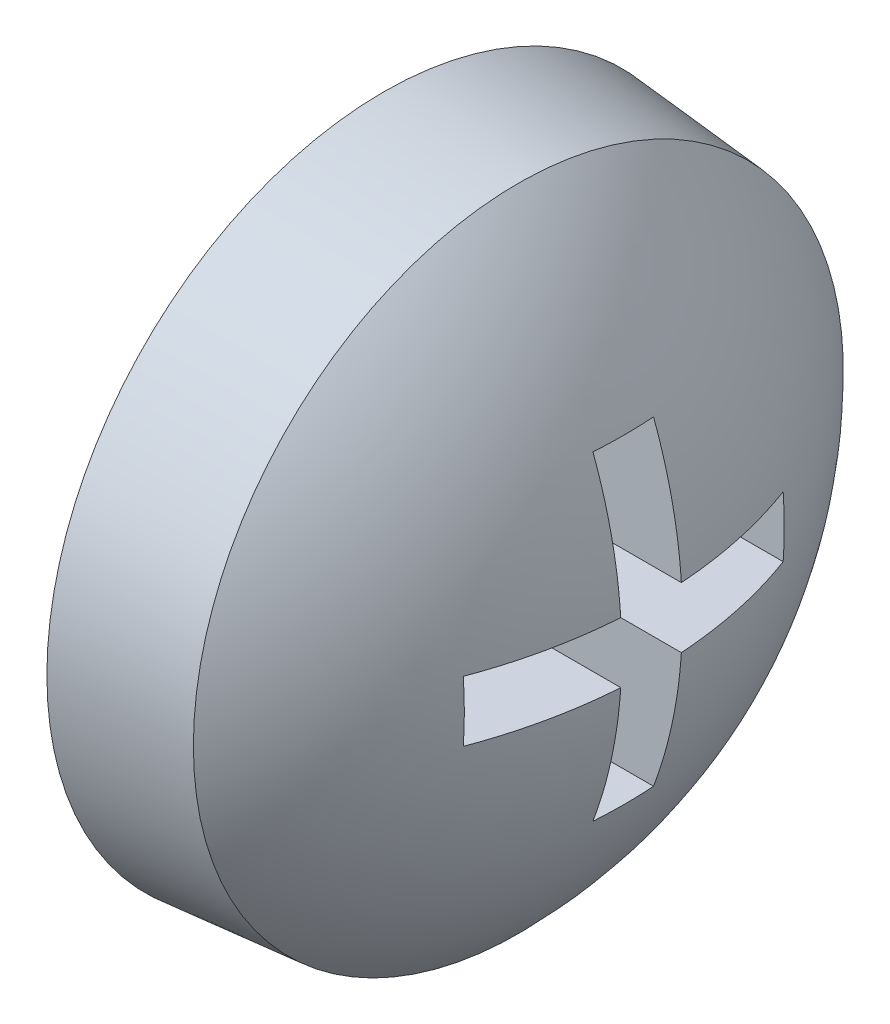
ISO-10303-21;
HEADER;
FILE_DESCRIPTION(('STEP AP214'),'2;1');
FILE_NAME('part.step','',(''),(''),'','','');
FILE_SCHEMA(('AUTOMOTIVE_DESIGN { 1 0 10303 214 1 1 1 1 }'));
ENDSEC;
DATA;
#1=APPLICATION_CONTEXT('core data for automotive mechanical design processes');
#2=APPLICATION_PROTOCOL_DEFINITION('international standard','automotive_design',2000,#1);
#3=PRODUCT_CONTEXT('',#1,'mechanical');
#4=PRODUCT('Part','Part','',(#3));
#5=PRODUCT_RELATED_PRODUCT_CATEGORY('part','',(#4));
#6=PRODUCT_DEFINITION_FORMATION('','',#4);
#7=PRODUCT_DEFINITION_CONTEXT('part definition',#1,'design');
#8=PRODUCT_DEFINITION('design','',#6,#7);
#9=PRODUCT_DEFINITION_SHAPE('','',#8);
#10=(LENGTH_UNIT() NAMED_UNIT(*) SI_UNIT(.MILLI.,.METRE.));
#11=(NAMED_UNIT(*) PLANE_ANGLE_UNIT() SI_UNIT($,.RADIAN.));
#12=(NAMED_UNIT(*) SI_UNIT($,.STERADIAN.) SOLID_ANGLE_UNIT());
#13=UNCERTAINTY_MEASURE_WITH_UNIT(LENGTH_MEASURE(1.E-05),#10,'distance_accuracy_value','');
#14=(GEOMETRIC_REPRESENTATION_CONTEXT(3) GLOBAL_UNCERTAINTY_ASSIGNED_CONTEXT((#13)) GLOBAL_UNIT_ASSIGNED_CONTEXT((#10,
#11,#12)) REPRESENTATION_CONTEXT('',''));
#15=CARTESIAN_POINT('',(0.,0.,0.));
#16=DIRECTION('',(0.,0.,1.));
#17=DIRECTION('',(1.,0.,0.));
#18=AXIS2_PLACEMENT_3D('',#15,#16,#17);
#19=CARTESIAN_POINT('',(219.066666666667,-6.9,10.));
#20=DIRECTION('',(1.,0.,0.));
#21=DIRECTION('',(0.,0.,-1.));
#22=AXIS2_PLACEMENT_3D('',#19,#20,#21);
#23=PLANE('',#22);
#24=DIRECTION('',(0.,0.,1.));
#25=VECTOR('',#24,1.);
#26=CARTESIAN_POINT('',(219.066666666667,-7.85,10.));
#27=LINE('',#26,#25);
#28=CARTESIAN_POINT('',(219.066666666667,-7.85,9.82));
#29=VERTEX_POINT('',#28);
#30=CARTESIAN_POINT('',(219.066666666667,-7.85,10.18));
#31=VERTEX_POINT('',#30);
#32=EDGE_CURVE('E293',#29,#31,#27,.T.);
#33=ORIENTED_EDGE('',*,*,#32,.F.);
#34=DIRECTION('',(0.,1.,0.));
#35=VECTOR('',#34,1.);
#36=CARTESIAN_POINT('',(219.066666666667,-6.9,9.82));
#37=LINE('',#36,#35);
#38=CARTESIAN_POINT('',(219.066666666667,-7.08,9.82));
#39=VERTEX_POINT('',#38);
#40=EDGE_CURVE('E298',#39,#29,#37,.F.);
#41=ORIENTED_EDGE('',*,*,#40,.F.);
#42=DIRECTION('',(0.,0.,1.));
#43=VECTOR('',#42,1.);
#44=CARTESIAN_POINT('',(219.066666666667,-7.08,10.));
#45=LINE('',#44,#43);
#46=CARTESIAN_POINT('',(219.066666666667,-7.08,9.05));
#47=VERTEX_POINT('',#46);
#48=EDGE_CURVE('E303',#47,#39,#45,.T.);
#49=ORIENTED_EDGE('',*,*,#48,.F.);
#50=DIRECTION('',(0.,1.,0.));
#51=VECTOR('',#50,1.);
#52=CARTESIAN_POINT('',(219.066666666667,-6.9,9.05));
#53=LINE('',#52,#51);
#54=CARTESIAN_POINT('',(219.066666666667,-6.72,9.05));
#55=VERTEX_POINT('',#54);
#56=EDGE_CURVE('E308',#55,#47,#53,.F.);
#57=ORIENTED_EDGE('',*,*,#56,.F.);
#58=DIRECTION('',(0.,0.,-1.));
#59=VECTOR('',#58,1.);
#60=CARTESIAN_POINT('',(219.066666666667,-6.72,10.));
#61=LINE('',#60,#59);
#62=CARTESIAN_POINT('',(219.066666666667,-6.72,9.82));
#63=VERTEX_POINT('',#62);
#64=EDGE_CURVE('E313',#63,#55,#61,.T.);
#65=ORIENTED_EDGE('',*,*,#64,.F.);
#66=DIRECTION('',(0.,1.,0.));
#67=VECTOR('',#66,1.);
#68=CARTESIAN_POINT('',(219.066666666667,-6.9,9.82));
#69=LINE('',#68,#67);
#70=CARTESIAN_POINT('',(219.066666666667,-5.95,9.82));
#71=VERTEX_POINT('',#70);
#72=EDGE_CURVE('E318',#71,#63,#69,.F.);
#73=ORIENTED_EDGE('',*,*,#72,.F.);
#74=DIRECTION('',(0.,0.,1.));
#75=VECTOR('',#74,1.);
#76=CARTESIAN_POINT('',(219.066666666667,-5.95,10.));
#77=LINE('',#76,#75);
#78=CARTESIAN_POINT('',(219.066666666667,-5.95,10.18));
#79=VERTEX_POINT('',#78);
#80=EDGE_CURVE('E267',#71,#79,#77,.T.);
#81=ORIENTED_EDGE('',*,*,#80,.T.);
#82=DIRECTION('',(0.,1.,0.));
#83=VECTOR('',#82,1.);
#84=CARTESIAN_POINT('',(219.066666666667,-6.9,10.18));
#85=LINE('',#84,#83);
#86=CARTESIAN_POINT('',(219.066666666667,-6.72,10.18));
#87=VERTEX_POINT('',#86);
#88=EDGE_CURVE('E264',#87,#79,#85,.T.);
#89=ORIENTED_EDGE('',*,*,#88,.F.);
#90=DIRECTION('',(0.,0.,-1.));
#91=VECTOR('',#90,1.);
#92=CARTESIAN_POINT('',(219.066666666667,-6.72,10.));
#93=LINE('',#92,#91);
#94=CARTESIAN_POINT('',(219.066666666667,-6.72,10.95));
#95=VERTEX_POINT('',#94);
#96=EDGE_CURVE('E260',#95,#87,#93,.T.);
#97=ORIENTED_EDGE('',*,*,#96,.F.);
#98=DIRECTION('',(0.,1.,0.));
#99=VECTOR('',#98,1.);
#100=CARTESIAN_POINT('',(219.066666666667,-6.9,10.95));
#101=LINE('',#100,#99);
#102=CARTESIAN_POINT('',(219.066666666667,-7.08,10.95));
#103=VERTEX_POINT('',#102);
#104=EDGE_CURVE('E231',#95,#103,#101,.F.);
#105=ORIENTED_EDGE('',*,*,#104,.T.);
#106=DIRECTION('',(0.,0.,1.));
#107=VECTOR('',#106,1.);
#108=CARTESIAN_POINT('',(219.066666666667,-7.08,10.));
#109=LINE('',#108,#107);
#110=CARTESIAN_POINT('',(219.066666666667,-7.08,10.18));
#111=VERTEX_POINT('',#110);
#112=EDGE_CURVE('E278',#111,#103,#109,.T.);
#113=ORIENTED_EDGE('',*,*,#112,.F.);
#114=DIRECTION('',(0.,1.,0.));
#115=VECTOR('',#114,1.);
#116=CARTESIAN_POINT('',(219.066666666667,-6.9,10.18));
#117=LINE('',#116,#115);
#118=EDGE_CURVE('E288',#31,#111,#117,.T.);
#119=ORIENTED_EDGE('',*,*,#118,.F.);
#120=EDGE_LOOP('',(#33,#41,#49,#57,#65,#73,#81,#89,#97,#105,#113,#119));
#121=FACE_BOUND('',#120,.T.);
#122=ADVANCED_FACE('F17',(#121),#23,.T.);
#123=CARTESIAN_POINT('',(219.666666666667,-6.72,10.));
#124=DIRECTION('',(0.,-1.,0.));
#125=DIRECTION('',(0.,0.,-1.));
#126=AXIS2_PLACEMENT_3D('',#123,#124,#125);
#127=PLANE('',#126);
#128=DIRECTION('',(1.,0.,0.));
#129=VECTOR('',#128,1.);
#130=CARTESIAN_POINT('',(219.666666666667,-6.72,10.95));
#131=LINE('',#130,#129);
#132=CARTESIAN_POINT('',(220.089571189858,-6.72,10.9499999999999));
#133=VERTEX_POINT('',#132);
#134=EDGE_CURVE('E89',#133,#95,#131,.F.);
#135=ORIENTED_EDGE('',*,*,#134,.T.);
#136=ORIENTED_EDGE('',*,*,#96,.T.);
#137=DIRECTION('',(-1.,0.,0.));
#138=VECTOR('',#137,1.);
#139=CARTESIAN_POINT('',(219.666666666667,-6.72,10.18));
#140=LINE('',#139,#138);
#141=CARTESIAN_POINT('',(220.254764236461,-6.72000000000002,10.18));
#142=VERTEX_POINT('',#141);
#143=EDGE_CURVE('E224',#142,#87,#140,.T.);
#144=ORIENTED_EDGE('',*,*,#143,.F.);
#145=CARTESIAN_POINT('',(220.089571189858,-6.72,10.9499999999998));
#146=CARTESIAN_POINT('',(220.101116204051,-6.72,10.9189995540504));
#147=CARTESIAN_POINT('',(220.112095586435,-6.72,10.8877884938065));
#148=CARTESIAN_POINT('',(220.132868784973,-6.72,10.8251104536467));
#149=CARTESIAN_POINT('',(220.142667091984,-6.72,10.7936449620739));
#150=CARTESIAN_POINT('',(220.161090632624,-6.72,10.7304618501354));
#151=CARTESIAN_POINT('',(220.169718872253,-6.72,10.6987451062671));
#152=CARTESIAN_POINT('',(220.18581062142,-6.72,10.6350619663154));
#153=CARTESIAN_POINT('',(220.193275650242,-6.72,10.6030959541241));
#154=CARTESIAN_POINT('',(220.207044828628,-6.72,10.5389148788567));
#155=CARTESIAN_POINT('',(220.213348978193,-6.72,10.5066998157807));
#156=CARTESIAN_POINT('',(220.224795725559,-6.72,10.4420201537523));
#157=CARTESIAN_POINT('',(220.229936780304,-6.72,10.4095552817085));
#158=CARTESIAN_POINT('',(220.239051828977,-6.72,10.3443751591892));
#159=CARTESIAN_POINT('',(220.243022721906,-6.72,10.3116594750372));
#160=CARTESIAN_POINT('',(220.249787708815,-6.72,10.2459761632456));
#161=CARTESIAN_POINT('',(220.252577096634,-6.72,10.2130080508537));
#162=CARTESIAN_POINT('',(220.25476423646,-6.72,10.18));
#163=B_SPLINE_CURVE_WITH_KNOTS('',3,(#145,#146,#147,#148,#149,#150,#151,#152,#153,#154,#155,
#156,#157,#158,#159,#160,#161,#162),.UNSPECIFIED.,.F.,.F.,(4,2,2,2,2,2,2,2,4),(0.,
0.0992357442434007,0.198081387639233,0.296668072480423,0.395124892694009,0.493581712907595,
0.592168397748798,0.691014041144628,0.790249785388024),.UNSPECIFIED.);
#164=EDGE_CURVE('E20',#133,#142,#163,.T.);
#165=ORIENTED_EDGE('',*,*,#164,.F.);
#166=EDGE_LOOP('',(#135,#136,#144,#165));
#167=FACE_BOUND('',#166,.T.);
#168=ADVANCED_FACE('F221',(#167),#127,.T.);
#169=CARTESIAN_POINT('',(219.666666666667,-6.9,10.18));
#170=DIRECTION('',(0.,0.,-1.));
#171=DIRECTION('',(-1.,0.,0.));
#172=AXIS2_PLACEMENT_3D('',#169,#170,#171);
#173=PLANE('',#172);
#174=ORIENTED_EDGE('',*,*,#88,.T.);
#175=DIRECTION('',(1.,0.,0.));
#176=VECTOR('',#175,1.);
#177=CARTESIAN_POINT('',(219.666666666667,-5.95,10.18));
#178=LINE('',#177,#176);
#179=CARTESIAN_POINT('',(220.089571189858,-5.95,10.18));
#180=VERTEX_POINT('',#179);
#181=EDGE_CURVE('E324',#79,#180,#178,.T.);
#182=ORIENTED_EDGE('',*,*,#181,.T.);
#183=CARTESIAN_POINT('',(220.25476423646,-6.72000000000004,10.18));
#184=CARTESIAN_POINT('',(220.249110057772,-6.63440991744423,10.18));
#185=CARTESIAN_POINT('',(220.239378570371,-6.54909652262237,10.18));
#186=CARTESIAN_POINT('',(220.212011452855,-6.38034093840239,10.18));
#187=CARTESIAN_POINT('',(220.194429898816,-6.29688998051813,10.18));
#188=CARTESIAN_POINT('',(220.149700769254,-6.12495750840967,10.18));
#189=CARTESIAN_POINT('',(220.121864706158,-6.03665468899671,10.18));
#190=CARTESIAN_POINT('',(220.089571189858,-5.9500000000002,10.18));
#191=B_SPLINE_CURVE_WITH_KNOTS('',3,(#183,#184,#185,#186,#187,#188,#189,#190),.UNSPECIFIED.,.F.,
.F.,(4,2,2,4),(0.,0.257221658829311,0.512698117737292,0.789983486231445),.UNSPECIFIED.);
#192=EDGE_CURVE('E213',#142,#180,#191,.T.);
#193=ORIENTED_EDGE('',*,*,#192,.F.);
#194=ORIENTED_EDGE('',*,*,#143,.T.);
#195=EDGE_LOOP('',(#174,#182,#193,#194));
#196=FACE_BOUND('',#195,.T.);
#197=ADVANCED_FACE('F204',(#196),#173,.T.);
#198=CARTESIAN_POINT('',(219.666666666667,-5.95,10.));
#199=DIRECTION('',(0.,1.,0.));
#200=DIRECTION('',(0.,0.,1.));
#201=AXIS2_PLACEMENT_3D('',#198,#199,#200);
#202=PLANE('',#201);
#203=ORIENTED_EDGE('',*,*,#181,.F.);
#204=ORIENTED_EDGE('',*,*,#80,.F.);
#205=DIRECTION('',(1.,0.,0.));
#206=VECTOR('',#205,1.);
#207=CARTESIAN_POINT('',(219.666666666667,-5.95,9.82));
#208=LINE('',#207,#206);
#209=CARTESIAN_POINT('',(220.089571189858,-5.9500000000001,9.82));
#210=VERTEX_POINT('',#209);
#211=EDGE_CURVE('E320',#210,#71,#208,.F.);
#212=ORIENTED_EDGE('',*,*,#211,.F.);
#213=CARTESIAN_POINT('',(220.089571189857,-5.95,10.18));
#214=CARTESIAN_POINT('',(220.093799585556,-5.94999999999998,10.12));
#215=CARTESIAN_POINT('',(220.095913783405,-5.94999999999998,10.06));
#216=CARTESIAN_POINT('',(220.095913783405,-5.95000000000002,9.93999999999997));
#217=CARTESIAN_POINT('',(220.093799585556,-5.95000000000006,9.87999999999998));
#218=CARTESIAN_POINT('',(220.089571189857,-5.95000000000011,9.81999999999998));
#219=B_SPLINE_CURVE_WITH_KNOTS('',3,(#213,#214,#215,#216,#217,#218),.UNSPECIFIED.,.F.,.F.,(4,2,
4),(0.,0.180111711148678,0.360223422297353),.UNSPECIFIED.);
#220=EDGE_CURVE('E207',#180,#210,#219,.T.);
#221=ORIENTED_EDGE('',*,*,#220,.F.);
#222=EDGE_LOOP('',(#203,#204,#212,#221));
#223=FACE_BOUND('',#222,.T.);
#224=ADVANCED_FACE('F199',(#223),#202,.F.);
#225=CARTESIAN_POINT('',(219.666666666667,-6.9,9.82));
#226=DIRECTION('',(0.,0.,1.));
#227=DIRECTION('',(1.,0.,0.));
#228=AXIS2_PLACEMENT_3D('',#225,#226,#227);
#229=PLANE('',#228);
#230=ORIENTED_EDGE('',*,*,#72,.T.);
#231=DIRECTION('',(1.,0.,0.));
#232=VECTOR('',#231,1.);
#233=CARTESIAN_POINT('',(219.666666666667,-6.72,9.82));
#234=LINE('',#233,#232);
#235=CARTESIAN_POINT('',(220.254764236461,-6.72,9.82000000000002));
#236=VERTEX_POINT('',#235);
#237=EDGE_CURVE('E315',#236,#63,#234,.F.);
#238=ORIENTED_EDGE('',*,*,#237,.F.);
#239=CARTESIAN_POINT('',(220.089571189858,-5.9500000000002,9.82));
#240=CARTESIAN_POINT('',(220.101116204051,-5.98100044594961,9.82));
#241=CARTESIAN_POINT('',(220.112095586435,-6.01221150619346,9.82));
#242=CARTESIAN_POINT('',(220.132868784973,-6.07488954635333,9.82));
#243=CARTESIAN_POINT('',(220.142667091984,-6.10635503792612,9.82));
#244=CARTESIAN_POINT('',(220.161090632624,-6.16953814986456,9.82));
#245=CARTESIAN_POINT('',(220.169718872253,-6.2012548937329,9.82));
#246=CARTESIAN_POINT('',(220.18581062142,-6.26493803368463,9.82));
#247=CARTESIAN_POINT('',(220.193275650242,-6.29690404587595,9.82));
#248=CARTESIAN_POINT('',(220.207044828628,-6.36108512114329,9.82));
#249=CARTESIAN_POINT('',(220.213348978193,-6.39330018421931,9.82));
#250=CARTESIAN_POINT('',(220.224795725559,-6.4579798462477,9.82));
#251=CARTESIAN_POINT('',(220.229936780304,-6.49044471829152,9.82));
#252=CARTESIAN_POINT('',(220.239051828977,-6.55562484081075,9.82));
#253=CARTESIAN_POINT('',(220.243022721906,-6.58834052496283,9.82));
#254=CARTESIAN_POINT('',(220.249787708815,-6.65402383675444,9.82));
#255=CARTESIAN_POINT('',(220.252577096634,-6.68699194914626,9.82));
#256=CARTESIAN_POINT('',(220.25476423646,-6.72000000000003,9.82));
#257=B_SPLINE_CURVE_WITH_KNOTS('',3,(#239,#240,#241,#242,#243,#244,#245,#246,#247,#248,#249,
#250,#251,#252,#253,#254,#255,#256),.UNSPECIFIED.,.F.,.F.,(4,2,2,2,2,2,2,2,4),(0.,
0.0992357442434007,0.198081387639233,0.296668072480425,0.395124892694009,0.493581712907593,
0.592168397748797,0.691014041144626,0.790249785388022),.UNSPECIFIED.);
#258=EDGE_CURVE('E184',#210,#236,#257,.T.);
#259=ORIENTED_EDGE('',*,*,#258,.F.);
#260=ORIENTED_EDGE('',*,*,#211,.T.);
#261=EDGE_LOOP('',(#230,#238,#259,#260));
#262=FACE_BOUND('',#261,.T.);
#263=ADVANCED_FACE('F194',(#262),#229,.T.);
#264=CARTESIAN_POINT('',(219.666666666667,-6.72,10.));
#265=DIRECTION('',(0.,-1.,0.));
#266=DIRECTION('',(0.,0.,-1.));
#267=AXIS2_PLACEMENT_3D('',#264,#265,#266);
#268=PLANE('',#267);
#269=DIRECTION('',(1.,0.,0.));
#270=VECTOR('',#269,1.);
#271=CARTESIAN_POINT('',(219.666666666667,-6.72,9.05));
#272=LINE('',#271,#270);
#273=CARTESIAN_POINT('',(220.089571189858,-6.72,9.05));
#274=VERTEX_POINT('',#273);
#275=EDGE_CURVE('E310',#274,#55,#272,.F.);
#276=ORIENTED_EDGE('',*,*,#275,.F.);
#277=CARTESIAN_POINT('',(220.25476423646,-6.72,9.82000000000004));
#278=CARTESIAN_POINT('',(220.249110057772,-6.72,9.73440991744424));
#279=CARTESIAN_POINT('',(220.239378570371,-6.72,9.64909652262238));
#280=CARTESIAN_POINT('',(220.212011452855,-6.72,9.4803409384024));
#281=CARTESIAN_POINT('',(220.194429898816,-6.72,9.39688998051813));
#282=CARTESIAN_POINT('',(220.149700769254,-6.72,9.22495750840968));
#283=CARTESIAN_POINT('',(220.121864706158,-6.72,9.13665468899671));
#284=CARTESIAN_POINT('',(220.089571189858,-6.72,9.0500000000002));
#285=B_SPLINE_CURVE_WITH_KNOTS('',3,(#277,#278,#279,#280,#281,#282,#283,#284),.UNSPECIFIED.,.F.,
.F.,(4,2,2,4),(0.,0.257221658829309,0.51269811773729,0.789983486231444),.UNSPECIFIED.);
#286=EDGE_CURVE('E176',#236,#274,#285,.T.);
#287=ORIENTED_EDGE('',*,*,#286,.F.);
#288=ORIENTED_EDGE('',*,*,#237,.T.);
#289=ORIENTED_EDGE('',*,*,#64,.T.);
#290=EDGE_LOOP('',(#276,#287,#288,#289));
#291=FACE_BOUND('',#290,.T.);
#292=ADVANCED_FACE('F191',(#291),#268,.T.);
#293=CARTESIAN_POINT('',(219.666666666667,-6.9,9.05));
#294=DIRECTION('',(0.,0.,1.));
#295=DIRECTION('',(1.,0.,0.));
#296=AXIS2_PLACEMENT_3D('',#293,#294,#295);
#297=PLANE('',#296);
#298=DIRECTION('',(1.,0.,0.));
#299=VECTOR('',#298,1.);
#300=CARTESIAN_POINT('',(219.666666666667,-7.08,9.05));
#301=LINE('',#300,#299);
#302=CARTESIAN_POINT('',(220.089571189858,-7.08,9.0500000000001));
#303=VERTEX_POINT('',#302);
#304=EDGE_CURVE('E305',#303,#47,#301,.F.);
#305=ORIENTED_EDGE('',*,*,#304,.F.);
#306=CARTESIAN_POINT('',(220.089571189858,-7.08,9.05));
#307=CARTESIAN_POINT('',(220.095913783405,-6.99011174581247,9.05));
#308=CARTESIAN_POINT('',(220.095913783405,-6.9,9.05));
#309=B_SPLINE_CURVE_WITH_KNOTS('',2,(#306,#307,#308),.UNSPECIFIED.,.F.,.F.,(3,3),(0.,1.),.UNSPECIFIED.);
#310=CARTESIAN_POINT('',(220.095913783405,-6.9,9.05));
#311=VERTEX_POINT('',#310);
#312=EDGE_CURVE('E175',#311,#303,#309,.F.);
#313=ORIENTED_EDGE('',*,*,#312,.F.);
#314=CARTESIAN_POINT('',(220.095913783405,-6.9,9.05));
#315=CARTESIAN_POINT('',(220.095913783405,-6.80988825418754,9.05));
#316=CARTESIAN_POINT('',(220.089571189858,-6.72,9.05));
#317=B_SPLINE_CURVE_WITH_KNOTS('',2,(#314,#315,#316),.UNSPECIFIED.,.F.,.F.,(3,3),(0.,1.),.UNSPECIFIED.);
#318=EDGE_CURVE('E183',#274,#311,#317,.F.);
#319=ORIENTED_EDGE('',*,*,#318,.F.);
#320=ORIENTED_EDGE('',*,*,#275,.T.);
#321=ORIENTED_EDGE('',*,*,#56,.T.);
#322=EDGE_LOOP('',(#305,#313,#319,#320,#321));
#323=FACE_BOUND('',#322,.T.);
#324=ADVANCED_FACE('F164',(#323),#297,.T.);
#325=CARTESIAN_POINT('',(219.666666666667,-7.08,10.));
#326=DIRECTION('',(0.,1.,0.));
#327=DIRECTION('',(0.,0.,1.));
#328=AXIS2_PLACEMENT_3D('',#325,#326,#327);
#329=PLANE('',#328);
#330=ORIENTED_EDGE('',*,*,#304,.T.);
#331=ORIENTED_EDGE('',*,*,#48,.T.);
#332=DIRECTION('',(1.,0.,0.));
#333=VECTOR('',#332,1.);
#334=CARTESIAN_POINT('',(219.666666666667,-7.08,9.82));
#335=LINE('',#334,#333);
#336=CARTESIAN_POINT('',(220.254764236461,-7.07999999999998,9.82));
#337=VERTEX_POINT('',#336);
#338=EDGE_CURVE('E300',#337,#39,#335,.F.);
#339=ORIENTED_EDGE('',*,*,#338,.F.);
#340=CARTESIAN_POINT('',(220.089571189858,-7.08,9.0500000000002));
#341=CARTESIAN_POINT('',(220.101116204051,-7.08,9.08100044594961));
#342=CARTESIAN_POINT('',(220.112095586435,-7.08,9.11221150619346));
#343=CARTESIAN_POINT('',(220.132868784973,-7.08,9.17488954635333));
#344=CARTESIAN_POINT('',(220.142667091984,-7.08,9.20635503792612));
#345=CARTESIAN_POINT('',(220.161090632624,-7.08,9.26953814986456));
#346=CARTESIAN_POINT('',(220.169718872253,-7.08,9.3012548937329));
#347=CARTESIAN_POINT('',(220.18581062142,-7.08,9.36493803368463));
#348=CARTESIAN_POINT('',(220.193275650242,-7.08,9.39690404587595));
#349=CARTESIAN_POINT('',(220.207044828628,-7.08,9.46108512114329));
#350=CARTESIAN_POINT('',(220.213348978193,-7.08,9.49330018421931));
#351=CARTESIAN_POINT('',(220.224795725559,-7.08,9.5579798462477));
#352=CARTESIAN_POINT('',(220.229936780304,-7.08,9.59044471829152));
#353=CARTESIAN_POINT('',(220.239051828977,-7.08,9.65562484081075));
#354=CARTESIAN_POINT('',(220.243022721906,-7.08,9.68834052496284));
#355=CARTESIAN_POINT('',(220.249787708815,-7.08,9.75402383675444));
#356=CARTESIAN_POINT('',(220.252577096634,-7.08,9.78699194914626));
#357=CARTESIAN_POINT('',(220.25476423646,-7.08,9.82000000000003));
#358=B_SPLINE_CURVE_WITH_KNOTS('',3,(#340,#341,#342,#343,#344,#345,#346,#347,#348,#349,#350,
#351,#352,#353,#354,#355,#356,#357),.UNSPECIFIED.,.F.,.F.,(4,2,2,2,2,2,2,2,4),(0.,
0.0992357442433991,0.198081387639233,0.296668072480423,0.395124892694009,0.493581712907594,
0.592168397748797,0.691014041144626,0.790249785388021),.UNSPECIFIED.);
#359=EDGE_CURVE('E168',#303,#337,#358,.T.);
#360=ORIENTED_EDGE('',*,*,#359,.F.);
#361=EDGE_LOOP('',(#330,#331,#339,#360));
#362=FACE_BOUND('',#361,.T.);
#363=ADVANCED_FACE('F159',(#362),#329,.T.);
#364=CARTESIAN_POINT('',(219.666666666667,-6.9,9.82));
#365=DIRECTION('',(0.,0.,1.));
#366=DIRECTION('',(1.,0.,0.));
#367=AXIS2_PLACEMENT_3D('',#364,#365,#366);
#368=PLANE('',#367);
#369=ORIENTED_EDGE('',*,*,#40,.T.);
#370=DIRECTION('',(1.,0.,0.));
#371=VECTOR('',#370,1.);
#372=CARTESIAN_POINT('',(219.666666666667,-7.85,9.82));
#373=LINE('',#372,#371);
#374=CARTESIAN_POINT('',(220.089571189858,-7.85,9.82000000000002));
#375=VERTEX_POINT('',#374);
#376=EDGE_CURVE('E295',#375,#29,#373,.F.);
#377=ORIENTED_EDGE('',*,*,#376,.F.);
#378=CARTESIAN_POINT('',(220.25476423646,-7.07999999999996,9.82));
#379=CARTESIAN_POINT('',(220.249110057772,-7.16559008255577,9.82));
#380=CARTESIAN_POINT('',(220.239378570371,-7.25090347737763,9.82));
#381=CARTESIAN_POINT('',(220.212011452855,-7.4196590615976,9.82));
#382=CARTESIAN_POINT('',(220.194429898816,-7.50311001948187,9.82));
#383=CARTESIAN_POINT('',(220.149700769254,-7.67504249159033,9.82));
#384=CARTESIAN_POINT('',(220.121864706158,-7.76334531100329,9.82));
#385=CARTESIAN_POINT('',(220.089571189858,-7.84999999999981,9.82));
#386=B_SPLINE_CURVE_WITH_KNOTS('',3,(#378,#379,#380,#381,#382,#383,#384,#385),.UNSPECIFIED.,.F.,
.F.,(4,2,2,4),(0.,0.257221658829311,0.512698117737291,0.789983486231447),.UNSPECIFIED.);
#387=EDGE_CURVE('E144',#337,#375,#386,.T.);
#388=ORIENTED_EDGE('',*,*,#387,.F.);
#389=ORIENTED_EDGE('',*,*,#338,.T.);
#390=EDGE_LOOP('',(#369,#377,#388,#389));
#391=FACE_BOUND('',#390,.T.);
#392=ADVANCED_FACE('F154',(#391),#368,.T.);
#393=CARTESIAN_POINT('',(219.666666666667,-7.85,10.));
#394=DIRECTION('',(0.,1.,0.));
#395=DIRECTION('',(0.,0.,1.));
#396=AXIS2_PLACEMENT_3D('',#393,#394,#395);
#397=PLANE('',#396);
#398=ORIENTED_EDGE('',*,*,#32,.T.);
#399=DIRECTION('',(-1.,0.,0.));
#400=VECTOR('',#399,1.);
#401=CARTESIAN_POINT('',(219.666666666667,-7.85,10.18));
#402=LINE('',#401,#400);
#403=CARTESIAN_POINT('',(220.089571189858,-7.8499999999999,10.18));
#404=VERTEX_POINT('',#403);
#405=EDGE_CURVE('E290',#404,#31,#402,.T.);
#406=ORIENTED_EDGE('',*,*,#405,.F.);
#407=CARTESIAN_POINT('',(220.089571189857,-7.85,9.82000000000004));
#408=CARTESIAN_POINT('',(220.093799585556,-7.85000000000001,9.88000000000004));
#409=CARTESIAN_POINT('',(220.095913783405,-7.85000000000001,9.94000000000004));
#410=CARTESIAN_POINT('',(220.095913783405,-7.84999999999999,10.06));
#411=CARTESIAN_POINT('',(220.093799585556,-7.84999999999997,10.12));
#412=CARTESIAN_POINT('',(220.089571189857,-7.84999999999994,10.18));
#413=B_SPLINE_CURVE_WITH_KNOTS('',3,(#407,#408,#409,#410,#411,#412),.UNSPECIFIED.,.F.,.F.,(4,2,
4),(0.,0.180111711148678,0.360223422297353),.UNSPECIFIED.);
#414=EDGE_CURVE('E137',#375,#404,#413,.T.);
#415=ORIENTED_EDGE('',*,*,#414,.F.);
#416=ORIENTED_EDGE('',*,*,#376,.T.);
#417=EDGE_LOOP('',(#398,#406,#415,#416));
#418=FACE_BOUND('',#417,.T.);
#419=ADVANCED_FACE('F151',(#418),#397,.T.);
#420=CARTESIAN_POINT('',(219.666666666667,-6.9,10.18));
#421=DIRECTION('',(0.,0.,-1.));
#422=DIRECTION('',(-1.,0.,0.));
#423=AXIS2_PLACEMENT_3D('',#420,#421,#422);
#424=PLANE('',#423);
#425=ORIENTED_EDGE('',*,*,#118,.T.);
#426=DIRECTION('',(1.,0.,0.));
#427=VECTOR('',#426,1.);
#428=CARTESIAN_POINT('',(219.666666666667,-7.08,10.18));
#429=LINE('',#428,#427);
#430=CARTESIAN_POINT('',(220.254764236461,-7.08,10.18));
#431=VERTEX_POINT('',#430);
#432=EDGE_CURVE('E280',#431,#111,#429,.F.);
#433=ORIENTED_EDGE('',*,*,#432,.F.);
#434=CARTESIAN_POINT('',(220.089571189858,-7.8499999999998,10.18));
#435=CARTESIAN_POINT('',(220.101116204051,-7.81899955405039,10.18));
#436=CARTESIAN_POINT('',(220.112095586435,-7.78778849380654,10.18));
#437=CARTESIAN_POINT('',(220.132868784973,-7.72511045364667,10.18));
#438=CARTESIAN_POINT('',(220.142667091984,-7.69364496207388,10.18));
#439=CARTESIAN_POINT('',(220.161090632624,-7.63046185013544,10.18));
#440=CARTESIAN_POINT('',(220.169718872253,-7.5987451062671,10.18));
#441=CARTESIAN_POINT('',(220.18581062142,-7.53506196631537,10.18));
#442=CARTESIAN_POINT('',(220.193275650242,-7.50309595412405,10.18));
#443=CARTESIAN_POINT('',(220.207044828628,-7.43891487885671,10.18));
#444=CARTESIAN_POINT('',(220.213348978193,-7.40669981578069,10.18));
#445=CARTESIAN_POINT('',(220.224795725559,-7.3420201537523,10.18));
#446=CARTESIAN_POINT('',(220.229936780304,-7.30955528170848,10.18));
#447=CARTESIAN_POINT('',(220.239051828977,-7.24437515918925,10.18));
#448=CARTESIAN_POINT('',(220.243022721906,-7.21165947503717,10.18));
#449=CARTESIAN_POINT('',(220.249787708815,-7.14597616324556,10.18));
#450=CARTESIAN_POINT('',(220.252577096634,-7.11300805085374,10.18));
#451=CARTESIAN_POINT('',(220.25476423646,-7.07999999999997,10.18));
#452=B_SPLINE_CURVE_WITH_KNOTS('',3,(#434,#435,#436,#437,#438,#439,#440,#441,#442,#443,#444,
#445,#446,#447,#448,#449,#450,#451),.UNSPECIFIED.,.F.,.F.,(4,2,2,2,2,2,2,2,4),(0.,
0.0992357442434007,0.198081387639233,0.296668072480425,0.395124892694009,0.493581712907593,
0.592168397748798,0.691014041144627,0.790249785388023),.UNSPECIFIED.);
#453=EDGE_CURVE('E100',#404,#431,#452,.T.);
#454=ORIENTED_EDGE('',*,*,#453,.F.);
#455=ORIENTED_EDGE('',*,*,#405,.T.);
#456=EDGE_LOOP('',(#425,#433,#454,#455));
#457=FACE_BOUND('',#456,.T.);
#458=ADVANCED_FACE('F123',(#457),#424,.T.);
#459=CARTESIAN_POINT('',(219.666666666667,-7.08,10.));
#460=DIRECTION('',(0.,1.,0.));
#461=DIRECTION('',(0.,0.,1.));
#462=AXIS2_PLACEMENT_3D('',#459,#460,#461);
#463=PLANE('',#462);
#464=DIRECTION('',(1.,0.,0.));
#465=VECTOR('',#464,1.);
#466=CARTESIAN_POINT('',(219.666666666667,-7.08,10.95));
#467=LINE('',#466,#465);
#468=CARTESIAN_POINT('',(220.089571189858,-7.08,10.95));
#469=VERTEX_POINT('',#468);
#470=EDGE_CURVE('E40',#103,#469,#467,.T.);
#471=ORIENTED_EDGE('',*,*,#470,.T.);
#472=CARTESIAN_POINT('',(220.25476423646,-7.08,10.18));
#473=CARTESIAN_POINT('',(220.249110057772,-7.08,10.2655900825558));
#474=CARTESIAN_POINT('',(220.239378570371,-7.08,10.3509034773776));
#475=CARTESIAN_POINT('',(220.212011452855,-7.08,10.5196590615976));
#476=CARTESIAN_POINT('',(220.194429898816,-7.08,10.6031100194819));
#477=CARTESIAN_POINT('',(220.149700769254,-7.08,10.7750424915903));
#478=CARTESIAN_POINT('',(220.121864706158,-7.08,10.8633453110033));
#479=CARTESIAN_POINT('',(220.089571189858,-7.08,10.9499999999998));
#480=B_SPLINE_CURVE_WITH_KNOTS('',3,(#472,#473,#474,#475,#476,#477,#478,#479),.UNSPECIFIED.,.F.,
.F.,(4,2,2,4),(0.,0.25722165882931,0.512698117737292,0.789983486231447),.UNSPECIFIED.);
#481=EDGE_CURVE('E96',#431,#469,#480,.T.);
#482=ORIENTED_EDGE('',*,*,#481,.F.);
#483=ORIENTED_EDGE('',*,*,#432,.T.);
#484=ORIENTED_EDGE('',*,*,#112,.T.);
#485=EDGE_LOOP('',(#471,#482,#483,#484));
#486=FACE_BOUND('',#485,.T.);
#487=ADVANCED_FACE('F115',(#486),#463,.T.);
#488=CARTESIAN_POINT('',(219.666666666667,-6.9,10.95));
#489=DIRECTION('',(0.,0.,1.));
#490=DIRECTION('',(1.,0.,0.));
#491=AXIS2_PLACEMENT_3D('',#488,#489,#490);
#492=PLANE('',#491);
#493=ORIENTED_EDGE('',*,*,#470,.F.);
#494=ORIENTED_EDGE('',*,*,#104,.F.);
#495=ORIENTED_EDGE('',*,*,#134,.F.);
#496=CARTESIAN_POINT('',(220.095913783405,-6.9,10.95));
#497=CARTESIAN_POINT('',(220.095913783405,-6.80988825418754,10.95));
#498=CARTESIAN_POINT('',(220.089571189858,-6.72,10.95));
#499=B_SPLINE_CURVE_WITH_KNOTS('',2,(#496,#497,#498),.UNSPECIFIED.,.F.,.F.,(3,3),(0.,1.),.UNSPECIFIED.);
#500=CARTESIAN_POINT('',(220.095913783405,-6.9,10.95));
#501=VERTEX_POINT('',#500);
#502=EDGE_CURVE('E82',#501,#133,#499,.T.);
#503=ORIENTED_EDGE('',*,*,#502,.F.);
#504=CARTESIAN_POINT('',(220.089571189858,-7.08,10.95));
#505=CARTESIAN_POINT('',(220.095913783405,-6.99011174581247,10.95));
#506=CARTESIAN_POINT('',(220.095913783405,-6.9,10.95));
#507=B_SPLINE_CURVE_WITH_KNOTS('',2,(#504,#505,#506),.UNSPECIFIED.,.F.,.F.,(3,3),(0.,1.),.UNSPECIFIED.);
#508=EDGE_CURVE('E85',#469,#501,#507,.T.);
#509=ORIENTED_EDGE('',*,*,#508,.F.);
#510=EDGE_LOOP('',(#493,#494,#495,#503,#509));
#511=FACE_BOUND('',#510,.T.);
#512=ADVANCED_FACE('F84',(#511),#492,.F.);
#513=CARTESIAN_POINT('',(217.53858228722,-6.9,10.));
#514=DIRECTION('',(1.,0.,0.));
#515=DIRECTION('',(0.,1.,0.));
#516=AXIS2_PLACEMENT_3D('',#513,#514,#515);
#517=SPHERICAL_SURFACE('',#516,2.72808437944638);
#518=CARTESIAN_POINT('',(219.466666666676,-6.9,10.));
#519=DIRECTION('',(-1.,0.,0.));
#520=DIRECTION('',(0.,0.,1.));
#521=AXIS2_PLACEMENT_3D('',#518,#519,#520);
#522=CIRCLE('',#521,1.93000906918229);
#523=CARTESIAN_POINT('',(219.466666666676,-6.90000000000007,11.9300090691823));
#524=VERTEX_POINT('',#523);
#525=EDGE_CURVE('E31',#524,#524,#522,.T.);
#526=ORIENTED_EDGE('',*,*,#525,.F.);
#527=EDGE_LOOP('',(#526));
#528=FACE_BOUND('',#527,.T.);
#529=ORIENTED_EDGE('',*,*,#481,.T.);
#530=ORIENTED_EDGE('',*,*,#508,.T.);
#531=ORIENTED_EDGE('',*,*,#502,.T.);
#532=ORIENTED_EDGE('',*,*,#164,.T.);
#533=ORIENTED_EDGE('',*,*,#192,.T.);
#534=ORIENTED_EDGE('',*,*,#220,.T.);
#535=ORIENTED_EDGE('',*,*,#258,.T.);
#536=ORIENTED_EDGE('',*,*,#286,.T.);
#537=ORIENTED_EDGE('',*,*,#318,.T.);
#538=ORIENTED_EDGE('',*,*,#312,.T.);
#539=ORIENTED_EDGE('',*,*,#359,.T.);
#540=ORIENTED_EDGE('',*,*,#387,.T.);
#541=ORIENTED_EDGE('',*,*,#414,.T.);
#542=ORIENTED_EDGE('',*,*,#453,.T.);
#543=EDGE_LOOP('',(#529,#530,#531,#532,#533,#534,#535,#536,#537,#538,#539,#540,#541,#542));
#544=FACE_BOUND('',#543,.T.);
#545=ADVANCED_FACE('F94',(#528,#544),#517,.T.);
#546=CARTESIAN_POINT('',(218.66666666665,-6.9,10.));
#547=DIRECTION('',(-1.,0.,0.));
#548=DIRECTION('',(0.,0.,1.));
#549=AXIS2_PLACEMENT_3D('',#546,#547,#548);
#550=CONICAL_SURFACE('',#549,2.00000000000045,0.0872664625936403);
#551=CARTESIAN_POINT('',(218.66666666665,-6.9,10.));
#552=DIRECTION('',(-1.,0.,0.));
#553=DIRECTION('',(0.,0.,1.));
#554=AXIS2_PLACEMENT_3D('',#551,#552,#553);
#555=CIRCLE('',#554,2.00000000000045);
#556=CARTESIAN_POINT('',(218.66666666665,-6.9,12.0000000000005));
#557=VERTEX_POINT('',#556);
#558=EDGE_CURVE('E11',#557,#557,#555,.T.);
#559=ORIENTED_EDGE('',*,*,#558,.F.);
#560=EDGE_LOOP('',(#559));
#561=FACE_BOUND('',#560,.T.);
#562=ORIENTED_EDGE('',*,*,#525,.T.);
#563=EDGE_LOOP('',(#562));
#564=FACE_BOUND('',#563,.T.);
#565=ADVANCED_FACE('F402',(#561,#564),#550,.T.);
#566=CARTESIAN_POINT('',(218.666666666667,-6.9,11.));
#567=DIRECTION('',(-1.,0.,0.));
#568=DIRECTION('',(0.,0.,1.));
#569=AXIS2_PLACEMENT_3D('',#566,#567,#568);
#570=PLANE('',#569);
#571=ORIENTED_EDGE('',*,*,#558,.T.);
#572=EDGE_LOOP('',(#571));
#573=FACE_BOUND('',#572,.T.);
#574=ADVANCED_FACE('F400',(#573),#570,.T.);
#575=CLOSED_SHELL('',(#122,#168,#197,#224,#263,#292,#324,#363,#392,#419,#458,#487,#512,#545,
#565,#574));
#576=MANIFOLD_SOLID_BREP('B1',#575);
#577=ADVANCED_BREP_SHAPE_REPRESENTATION('',(#18,#576),#14);
#578=SHAPE_DEFINITION_REPRESENTATION(#9,#577);
ENDSEC;
END-ISO-10303-21;
